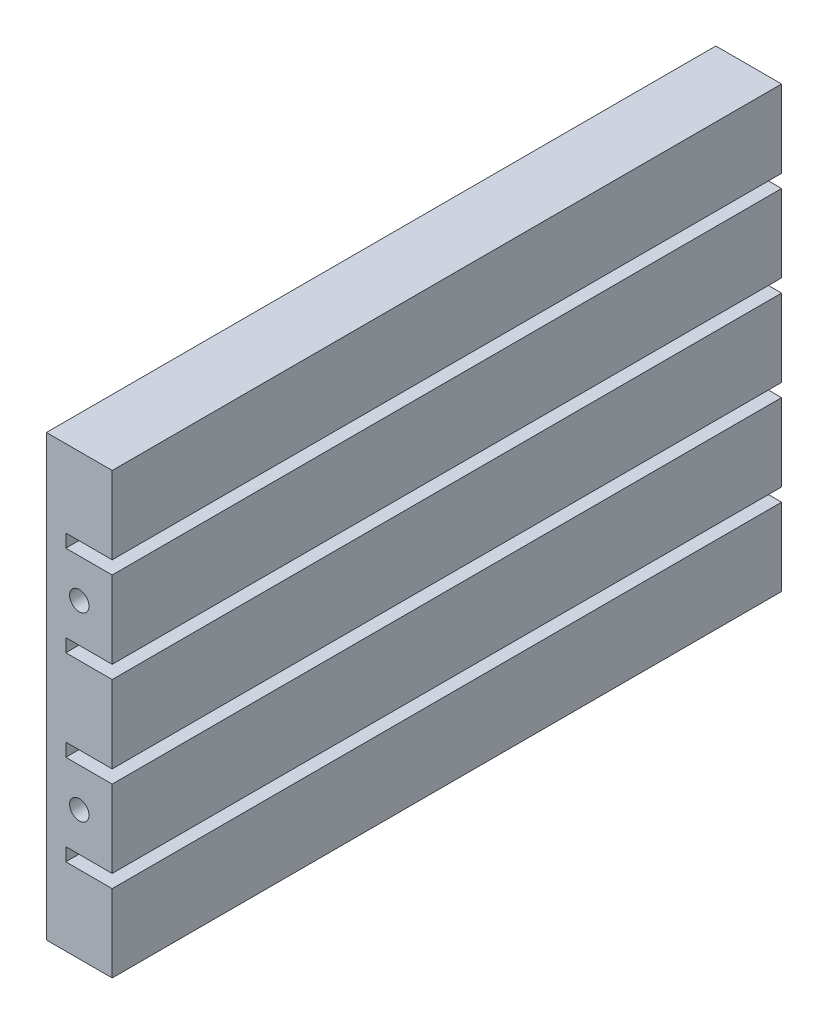
ISO-10303-21;
HEADER;
FILE_DESCRIPTION(('STEP AP214'),'2;1');
FILE_NAME('part.step','',(''),(''),'','','');
FILE_SCHEMA(('AUTOMOTIVE_DESIGN { 1 0 10303 214 1 1 1 1 }'));
ENDSEC;
DATA;
#1=APPLICATION_CONTEXT('core data for automotive mechanical design processes');
#2=APPLICATION_PROTOCOL_DEFINITION('international standard','automotive_design',2000,#1);
#3=PRODUCT_CONTEXT('',#1,'mechanical');
#4=PRODUCT('Part','Part','',(#3));
#5=PRODUCT_RELATED_PRODUCT_CATEGORY('part','',(#4));
#6=PRODUCT_DEFINITION_FORMATION('','',#4);
#7=PRODUCT_DEFINITION_CONTEXT('part definition',#1,'design');
#8=PRODUCT_DEFINITION('design','',#6,#7);
#9=PRODUCT_DEFINITION_SHAPE('','',#8);
#10=(LENGTH_UNIT() NAMED_UNIT(*) SI_UNIT(.MILLI.,.METRE.));
#11=(NAMED_UNIT(*) PLANE_ANGLE_UNIT() SI_UNIT($,.RADIAN.));
#12=(NAMED_UNIT(*) SI_UNIT($,.STERADIAN.) SOLID_ANGLE_UNIT());
#13=UNCERTAINTY_MEASURE_WITH_UNIT(LENGTH_MEASURE(1.E-05),#10,'distance_accuracy_value','');
#14=(GEOMETRIC_REPRESENTATION_CONTEXT(3) GLOBAL_UNCERTAINTY_ASSIGNED_CONTEXT((#13)) GLOBAL_UNIT_ASSIGNED_CONTEXT((#10,
#11,#12)) REPRESENTATION_CONTEXT('',''));
#15=CARTESIAN_POINT('',(0.,0.,0.));
#16=DIRECTION('',(0.,0.,1.));
#17=DIRECTION('',(1.,0.,0.));
#18=AXIS2_PLACEMENT_3D('',#15,#16,#17);
#19=CARTESIAN_POINT('',(8.50000000000001,0.,86.5));
#20=DIRECTION('',(0.,1.,0.));
#21=DIRECTION('',(0.,0.,1.));
#22=AXIS2_PLACEMENT_3D('',#19,#20,#21);
#23=PLANE('',#22);
#24=DIRECTION('',(1.,0.,0.));
#25=VECTOR('',#24,1.);
#26=CARTESIAN_POINT('',(8.50000000000001,0.,0.));
#27=LINE('',#26,#25);
#28=CARTESIAN_POINT('',(0.,0.,0.));
#29=VERTEX_POINT('',#28);
#30=CARTESIAN_POINT('',(8.50000000000001,0.,0.));
#31=VERTEX_POINT('',#30);
#32=EDGE_CURVE('E210',#29,#31,#27,.T.);
#33=ORIENTED_EDGE('',*,*,#32,.T.);
#34=DIRECTION('',(0.,0.,-1.));
#35=VECTOR('',#34,1.);
#36=CARTESIAN_POINT('',(8.50000000000001,0.,86.5));
#37=LINE('',#36,#35);
#38=CARTESIAN_POINT('',(8.50000000000001,0.,86.5));
#39=VERTEX_POINT('',#38);
#40=EDGE_CURVE('E11',#39,#31,#37,.T.);
#41=ORIENTED_EDGE('',*,*,#40,.F.);
#42=DIRECTION('',(1.,0.,0.));
#43=VECTOR('',#42,1.);
#44=CARTESIAN_POINT('',(8.50000000000001,0.,86.5));
#45=LINE('',#44,#43);
#46=CARTESIAN_POINT('',(0.,0.,86.5));
#47=VERTEX_POINT('',#46);
#48=EDGE_CURVE('E249',#47,#39,#45,.T.);
#49=ORIENTED_EDGE('',*,*,#48,.F.);
#50=DIRECTION('',(0.,0.,-1.));
#51=VECTOR('',#50,1.);
#52=CARTESIAN_POINT('',(0.,0.,86.5));
#53=LINE('',#52,#51);
#54=EDGE_CURVE('E206',#47,#29,#53,.T.);
#55=ORIENTED_EDGE('',*,*,#54,.T.);
#56=EDGE_LOOP('',(#33,#41,#49,#55));
#57=FACE_BOUND('',#56,.T.);
#58=ADVANCED_FACE('F39',(#57),#23,.F.);
#59=CARTESIAN_POINT('',(8.50000000000001,9.99999999999999,86.5));
#60=DIRECTION('',(-1.,0.,0.));
#61=DIRECTION('',(0.,0.,1.));
#62=AXIS2_PLACEMENT_3D('',#59,#60,#61);
#63=PLANE('',#62);
#64=DIRECTION('',(0.,1.,0.));
#65=VECTOR('',#64,1.);
#66=CARTESIAN_POINT('',(8.50000000000001,9.99999999999999,0.));
#67=LINE('',#66,#65);
#68=CARTESIAN_POINT('',(8.50000000000001,9.99999999999999,0.));
#69=VERTEX_POINT('',#68);
#70=EDGE_CURVE('E213',#31,#69,#67,.T.);
#71=ORIENTED_EDGE('',*,*,#70,.T.);
#72=DIRECTION('',(0.,0.,-1.));
#73=VECTOR('',#72,1.);
#74=CARTESIAN_POINT('',(8.50000000000001,9.99999999999999,86.5));
#75=LINE('',#74,#73);
#76=CARTESIAN_POINT('',(8.50000000000001,9.99999999999999,86.5));
#77=VERTEX_POINT('',#76);
#78=EDGE_CURVE('E47',#77,#69,#75,.T.);
#79=ORIENTED_EDGE('',*,*,#78,.F.);
#80=DIRECTION('',(0.,1.,0.));
#81=VECTOR('',#80,1.);
#82=CARTESIAN_POINT('',(8.50000000000001,9.99999999999999,86.5));
#83=LINE('',#82,#81);
#84=EDGE_CURVE('E135',#39,#77,#83,.T.);
#85=ORIENTED_EDGE('',*,*,#84,.F.);
#86=ORIENTED_EDGE('',*,*,#40,.T.);
#87=EDGE_LOOP('',(#71,#79,#85,#86));
#88=FACE_BOUND('',#87,.T.);
#89=ADVANCED_FACE('F373',(#88),#63,.F.);
#90=CARTESIAN_POINT('',(2.5,9.99999999999999,86.5));
#91=DIRECTION('',(0.,-1.,0.));
#92=DIRECTION('',(0.,0.,-1.));
#93=AXIS2_PLACEMENT_3D('',#90,#91,#92);
#94=PLANE('',#93);
#95=DIRECTION('',(-1.,0.,0.));
#96=VECTOR('',#95,1.);
#97=CARTESIAN_POINT('',(2.5,9.99999999999999,0.));
#98=LINE('',#97,#96);
#99=CARTESIAN_POINT('',(2.5,9.99999999999999,0.));
#100=VERTEX_POINT('',#99);
#101=EDGE_CURVE('E216',#69,#100,#98,.T.);
#102=ORIENTED_EDGE('',*,*,#101,.T.);
#103=DIRECTION('',(0.,0.,-1.));
#104=VECTOR('',#103,1.);
#105=CARTESIAN_POINT('',(2.5,9.99999999999999,86.5));
#106=LINE('',#105,#104);
#107=CARTESIAN_POINT('',(2.5,9.99999999999999,86.5));
#108=VERTEX_POINT('',#107);
#109=EDGE_CURVE('E292',#108,#100,#106,.T.);
#110=ORIENTED_EDGE('',*,*,#109,.F.);
#111=DIRECTION('',(-1.,0.,0.));
#112=VECTOR('',#111,1.);
#113=CARTESIAN_POINT('',(2.5,9.99999999999999,86.5));
#114=LINE('',#113,#112);
#115=EDGE_CURVE('E300',#77,#108,#114,.T.);
#116=ORIENTED_EDGE('',*,*,#115,.F.);
#117=ORIENTED_EDGE('',*,*,#78,.T.);
#118=EDGE_LOOP('',(#102,#110,#116,#117));
#119=FACE_BOUND('',#118,.T.);
#120=ADVANCED_FACE('F298',(#119),#94,.F.);
#121=CARTESIAN_POINT('',(2.5,11.7,86.5));
#122=DIRECTION('',(-1.,0.,0.));
#123=DIRECTION('',(0.,0.,1.));
#124=AXIS2_PLACEMENT_3D('',#121,#122,#123);
#125=PLANE('',#124);
#126=DIRECTION('',(0.,1.,0.));
#127=VECTOR('',#126,1.);
#128=CARTESIAN_POINT('',(2.5,11.7,0.));
#129=LINE('',#128,#127);
#130=CARTESIAN_POINT('',(2.5,11.7,0.));
#131=VERTEX_POINT('',#130);
#132=EDGE_CURVE('E218',#100,#131,#129,.T.);
#133=ORIENTED_EDGE('',*,*,#132,.T.);
#134=DIRECTION('',(0.,0.,-1.));
#135=VECTOR('',#134,1.);
#136=CARTESIAN_POINT('',(2.5,11.7,86.5));
#137=LINE('',#136,#135);
#138=CARTESIAN_POINT('',(2.5,11.7,86.5));
#139=VERTEX_POINT('',#138);
#140=EDGE_CURVE('E289',#139,#131,#137,.T.);
#141=ORIENTED_EDGE('',*,*,#140,.F.);
#142=DIRECTION('',(0.,1.,0.));
#143=VECTOR('',#142,1.);
#144=CARTESIAN_POINT('',(2.5,11.7,86.5));
#145=LINE('',#144,#143);
#146=EDGE_CURVE('E318',#108,#139,#145,.T.);
#147=ORIENTED_EDGE('',*,*,#146,.F.);
#148=ORIENTED_EDGE('',*,*,#109,.T.);
#149=EDGE_LOOP('',(#133,#141,#147,#148));
#150=FACE_BOUND('',#149,.T.);
#151=ADVANCED_FACE('F309',(#150),#125,.F.);
#152=CARTESIAN_POINT('',(8.50000000000001,11.7,86.5));
#153=DIRECTION('',(0.,1.,0.));
#154=DIRECTION('',(0.,0.,1.));
#155=AXIS2_PLACEMENT_3D('',#152,#153,#154);
#156=PLANE('',#155);
#157=DIRECTION('',(1.,0.,0.));
#158=VECTOR('',#157,1.);
#159=CARTESIAN_POINT('',(8.50000000000001,11.7,0.));
#160=LINE('',#159,#158);
#161=CARTESIAN_POINT('',(8.50000000000001,11.7,0.));
#162=VERTEX_POINT('',#161);
#163=EDGE_CURVE('E220',#131,#162,#160,.T.);
#164=ORIENTED_EDGE('',*,*,#163,.T.);
#165=DIRECTION('',(0.,0.,-1.));
#166=VECTOR('',#165,1.);
#167=CARTESIAN_POINT('',(8.50000000000001,11.7,86.5));
#168=LINE('',#167,#166);
#169=CARTESIAN_POINT('',(8.50000000000001,11.7,86.5));
#170=VERTEX_POINT('',#169);
#171=EDGE_CURVE('E286',#170,#162,#168,.T.);
#172=ORIENTED_EDGE('',*,*,#171,.F.);
#173=DIRECTION('',(1.,0.,0.));
#174=VECTOR('',#173,1.);
#175=CARTESIAN_POINT('',(8.50000000000001,11.7,86.5));
#176=LINE('',#175,#174);
#177=EDGE_CURVE('E315',#139,#170,#176,.T.);
#178=ORIENTED_EDGE('',*,*,#177,.F.);
#179=ORIENTED_EDGE('',*,*,#140,.T.);
#180=EDGE_LOOP('',(#164,#172,#178,#179));
#181=FACE_BOUND('',#180,.T.);
#182=ADVANCED_FACE('F313',(#181),#156,.F.);
#183=CARTESIAN_POINT('',(8.50000000000001,21.7,86.5));
#184=DIRECTION('',(-1.,0.,0.));
#185=DIRECTION('',(0.,-1.,0.));
#186=AXIS2_PLACEMENT_3D('',#183,#184,#185);
#187=PLANE('',#186);
#188=DIRECTION('',(0.,1.,0.));
#189=VECTOR('',#188,1.);
#190=CARTESIAN_POINT('',(8.50000000000001,21.7,0.));
#191=LINE('',#190,#189);
#192=CARTESIAN_POINT('',(8.50000000000001,21.7,0.));
#193=VERTEX_POINT('',#192);
#194=EDGE_CURVE('E222',#162,#193,#191,.T.);
#195=ORIENTED_EDGE('',*,*,#194,.T.);
#196=DIRECTION('',(0.,0.,-1.));
#197=VECTOR('',#196,1.);
#198=CARTESIAN_POINT('',(8.50000000000001,21.7,86.5));
#199=LINE('',#198,#197);
#200=CARTESIAN_POINT('',(8.50000000000001,21.7,86.5));
#201=VERTEX_POINT('',#200);
#202=EDGE_CURVE('E283',#201,#193,#199,.T.);
#203=ORIENTED_EDGE('',*,*,#202,.F.);
#204=DIRECTION('',(0.,1.,0.));
#205=VECTOR('',#204,1.);
#206=CARTESIAN_POINT('',(8.50000000000001,21.7,86.5));
#207=LINE('',#206,#205);
#208=EDGE_CURVE('E317',#170,#201,#207,.T.);
#209=ORIENTED_EDGE('',*,*,#208,.F.);
#210=ORIENTED_EDGE('',*,*,#171,.T.);
#211=EDGE_LOOP('',(#195,#203,#209,#210));
#212=FACE_BOUND('',#211,.T.);
#213=ADVANCED_FACE('F386',(#212),#187,.F.);
#214=CARTESIAN_POINT('',(2.5,21.7,86.5));
#215=DIRECTION('',(0.,-1.,0.));
#216=DIRECTION('',(0.,0.,-1.));
#217=AXIS2_PLACEMENT_3D('',#214,#215,#216);
#218=PLANE('',#217);
#219=DIRECTION('',(-1.,0.,0.));
#220=VECTOR('',#219,1.);
#221=CARTESIAN_POINT('',(2.5,21.7,0.));
#222=LINE('',#221,#220);
#223=CARTESIAN_POINT('',(2.5,21.7,0.));
#224=VERTEX_POINT('',#223);
#225=EDGE_CURVE('E224',#193,#224,#222,.T.);
#226=ORIENTED_EDGE('',*,*,#225,.T.);
#227=DIRECTION('',(0.,0.,-1.));
#228=VECTOR('',#227,1.);
#229=CARTESIAN_POINT('',(2.5,21.7,86.5));
#230=LINE('',#229,#228);
#231=CARTESIAN_POINT('',(2.5,21.7,86.5));
#232=VERTEX_POINT('',#231);
#233=EDGE_CURVE('E280',#232,#224,#230,.T.);
#234=ORIENTED_EDGE('',*,*,#233,.F.);
#235=DIRECTION('',(-1.,0.,0.));
#236=VECTOR('',#235,1.);
#237=CARTESIAN_POINT('',(2.5,21.7,86.5));
#238=LINE('',#237,#236);
#239=EDGE_CURVE('E320',#201,#232,#238,.T.);
#240=ORIENTED_EDGE('',*,*,#239,.F.);
#241=ORIENTED_EDGE('',*,*,#202,.T.);
#242=EDGE_LOOP('',(#226,#234,#240,#241));
#243=FACE_BOUND('',#242,.T.);
#244=ADVANCED_FACE('F389',(#243),#218,.F.);
#245=CARTESIAN_POINT('',(2.5,23.4,86.5));
#246=DIRECTION('',(-1.,0.,0.));
#247=DIRECTION('',(0.,0.,1.));
#248=AXIS2_PLACEMENT_3D('',#245,#246,#247);
#249=PLANE('',#248);
#250=DIRECTION('',(0.,1.,0.));
#251=VECTOR('',#250,1.);
#252=CARTESIAN_POINT('',(2.5,23.4,0.));
#253=LINE('',#252,#251);
#254=CARTESIAN_POINT('',(2.5,23.4,0.));
#255=VERTEX_POINT('',#254);
#256=EDGE_CURVE('E226',#224,#255,#253,.T.);
#257=ORIENTED_EDGE('',*,*,#256,.T.);
#258=DIRECTION('',(0.,0.,-1.));
#259=VECTOR('',#258,1.);
#260=CARTESIAN_POINT('',(2.5,23.4,86.5));
#261=LINE('',#260,#259);
#262=CARTESIAN_POINT('',(2.5,23.4,86.5));
#263=VERTEX_POINT('',#262);
#264=EDGE_CURVE('E277',#263,#255,#261,.T.);
#265=ORIENTED_EDGE('',*,*,#264,.F.);
#266=DIRECTION('',(0.,1.,0.));
#267=VECTOR('',#266,1.);
#268=CARTESIAN_POINT('',(2.5,23.4,86.5));
#269=LINE('',#268,#267);
#270=EDGE_CURVE('E326',#232,#263,#269,.T.);
#271=ORIENTED_EDGE('',*,*,#270,.F.);
#272=ORIENTED_EDGE('',*,*,#233,.T.);
#273=EDGE_LOOP('',(#257,#265,#271,#272));
#274=FACE_BOUND('',#273,.T.);
#275=ADVANCED_FACE('F393',(#274),#249,.F.);
#276=CARTESIAN_POINT('',(8.50000000000001,23.4,86.5));
#277=DIRECTION('',(0.,1.,0.));
#278=DIRECTION('',(0.,0.,1.));
#279=AXIS2_PLACEMENT_3D('',#276,#277,#278);
#280=PLANE('',#279);
#281=DIRECTION('',(1.,0.,0.));
#282=VECTOR('',#281,1.);
#283=CARTESIAN_POINT('',(8.50000000000001,23.4,0.));
#284=LINE('',#283,#282);
#285=CARTESIAN_POINT('',(8.50000000000001,23.4,0.));
#286=VERTEX_POINT('',#285);
#287=EDGE_CURVE('E228',#255,#286,#284,.T.);
#288=ORIENTED_EDGE('',*,*,#287,.T.);
#289=DIRECTION('',(0.,0.,-1.));
#290=VECTOR('',#289,1.);
#291=CARTESIAN_POINT('',(8.50000000000001,23.4,86.5));
#292=LINE('',#291,#290);
#293=CARTESIAN_POINT('',(8.50000000000001,23.4,86.5));
#294=VERTEX_POINT('',#293);
#295=EDGE_CURVE('E274',#294,#286,#292,.T.);
#296=ORIENTED_EDGE('',*,*,#295,.F.);
#297=DIRECTION('',(1.,0.,0.));
#298=VECTOR('',#297,1.);
#299=CARTESIAN_POINT('',(8.50000000000001,23.4,86.5));
#300=LINE('',#299,#298);
#301=EDGE_CURVE('E328',#263,#294,#300,.T.);
#302=ORIENTED_EDGE('',*,*,#301,.F.);
#303=ORIENTED_EDGE('',*,*,#264,.T.);
#304=EDGE_LOOP('',(#288,#296,#302,#303));
#305=FACE_BOUND('',#304,.T.);
#306=ADVANCED_FACE('F397',(#305),#280,.F.);
#307=CARTESIAN_POINT('',(8.5,33.4,86.5));
#308=DIRECTION('',(-1.,0.,0.));
#309=DIRECTION('',(0.,-1.,0.));
#310=AXIS2_PLACEMENT_3D('',#307,#308,#309);
#311=PLANE('',#310);
#312=DIRECTION('',(0.,1.,0.));
#313=VECTOR('',#312,1.);
#314=CARTESIAN_POINT('',(8.5,33.4,0.));
#315=LINE('',#314,#313);
#316=CARTESIAN_POINT('',(8.5,33.4,0.));
#317=VERTEX_POINT('',#316);
#318=EDGE_CURVE('E230',#286,#317,#315,.T.);
#319=ORIENTED_EDGE('',*,*,#318,.T.);
#320=DIRECTION('',(0.,0.,-1.));
#321=VECTOR('',#320,1.);
#322=CARTESIAN_POINT('',(8.5,33.4,86.5));
#323=LINE('',#322,#321);
#324=CARTESIAN_POINT('',(8.5,33.4,86.5));
#325=VERTEX_POINT('',#324);
#326=EDGE_CURVE('E271',#325,#317,#323,.T.);
#327=ORIENTED_EDGE('',*,*,#326,.F.);
#328=DIRECTION('',(0.,1.,0.));
#329=VECTOR('',#328,1.);
#330=CARTESIAN_POINT('',(8.5,33.4,86.5));
#331=LINE('',#330,#329);
#332=EDGE_CURVE('E330',#294,#325,#331,.T.);
#333=ORIENTED_EDGE('',*,*,#332,.F.);
#334=ORIENTED_EDGE('',*,*,#295,.T.);
#335=EDGE_LOOP('',(#319,#327,#333,#334));
#336=FACE_BOUND('',#335,.T.);
#337=ADVANCED_FACE('F401',(#336),#311,.F.);
#338=CARTESIAN_POINT('',(2.5,33.4,86.5));
#339=DIRECTION('',(0.,-1.,0.));
#340=DIRECTION('',(0.,0.,-1.));
#341=AXIS2_PLACEMENT_3D('',#338,#339,#340);
#342=PLANE('',#341);
#343=DIRECTION('',(-1.,0.,0.));
#344=VECTOR('',#343,1.);
#345=CARTESIAN_POINT('',(2.5,33.4,0.));
#346=LINE('',#345,#344);
#347=CARTESIAN_POINT('',(2.5,33.4,0.));
#348=VERTEX_POINT('',#347);
#349=EDGE_CURVE('E232',#317,#348,#346,.T.);
#350=ORIENTED_EDGE('',*,*,#349,.T.);
#351=DIRECTION('',(0.,0.,-1.));
#352=VECTOR('',#351,1.);
#353=CARTESIAN_POINT('',(2.5,33.4,86.5));
#354=LINE('',#353,#352);
#355=CARTESIAN_POINT('',(2.5,33.4,86.5));
#356=VERTEX_POINT('',#355);
#357=EDGE_CURVE('E268',#356,#348,#354,.T.);
#358=ORIENTED_EDGE('',*,*,#357,.F.);
#359=DIRECTION('',(-1.,0.,0.));
#360=VECTOR('',#359,1.);
#361=CARTESIAN_POINT('',(2.5,33.4,86.5));
#362=LINE('',#361,#360);
#363=EDGE_CURVE('E332',#325,#356,#362,.T.);
#364=ORIENTED_EDGE('',*,*,#363,.F.);
#365=ORIENTED_EDGE('',*,*,#326,.T.);
#366=EDGE_LOOP('',(#350,#358,#364,#365));
#367=FACE_BOUND('',#366,.T.);
#368=ADVANCED_FACE('F405',(#367),#342,.F.);
#369=CARTESIAN_POINT('',(2.5,35.1,86.5));
#370=DIRECTION('',(-1.,0.,0.));
#371=DIRECTION('',(0.,0.,1.));
#372=AXIS2_PLACEMENT_3D('',#369,#370,#371);
#373=PLANE('',#372);
#374=DIRECTION('',(0.,1.,0.));
#375=VECTOR('',#374,1.);
#376=CARTESIAN_POINT('',(2.5,35.1,0.));
#377=LINE('',#376,#375);
#378=CARTESIAN_POINT('',(2.5,35.1,0.));
#379=VERTEX_POINT('',#378);
#380=EDGE_CURVE('E234',#348,#379,#377,.T.);
#381=ORIENTED_EDGE('',*,*,#380,.T.);
#382=DIRECTION('',(0.,0.,-1.));
#383=VECTOR('',#382,1.);
#384=CARTESIAN_POINT('',(2.5,35.1,86.5));
#385=LINE('',#384,#383);
#386=CARTESIAN_POINT('',(2.5,35.1,86.5));
#387=VERTEX_POINT('',#386);
#388=EDGE_CURVE('E265',#387,#379,#385,.T.);
#389=ORIENTED_EDGE('',*,*,#388,.F.);
#390=DIRECTION('',(0.,1.,0.));
#391=VECTOR('',#390,1.);
#392=CARTESIAN_POINT('',(2.5,35.1,86.5));
#393=LINE('',#392,#391);
#394=EDGE_CURVE('E334',#356,#387,#393,.T.);
#395=ORIENTED_EDGE('',*,*,#394,.F.);
#396=ORIENTED_EDGE('',*,*,#357,.T.);
#397=EDGE_LOOP('',(#381,#389,#395,#396));
#398=FACE_BOUND('',#397,.T.);
#399=ADVANCED_FACE('F409',(#398),#373,.F.);
#400=CARTESIAN_POINT('',(8.5,35.1,86.5));
#401=DIRECTION('',(0.,1.,0.));
#402=DIRECTION('',(0.,0.,1.));
#403=AXIS2_PLACEMENT_3D('',#400,#401,#402);
#404=PLANE('',#403);
#405=DIRECTION('',(1.,0.,0.));
#406=VECTOR('',#405,1.);
#407=CARTESIAN_POINT('',(8.5,35.1,0.));
#408=LINE('',#407,#406);
#409=CARTESIAN_POINT('',(8.5,35.1,0.));
#410=VERTEX_POINT('',#409);
#411=EDGE_CURVE('E236',#379,#410,#408,.T.);
#412=ORIENTED_EDGE('',*,*,#411,.T.);
#413=DIRECTION('',(0.,0.,-1.));
#414=VECTOR('',#413,1.);
#415=CARTESIAN_POINT('',(8.5,35.1,86.5));
#416=LINE('',#415,#414);
#417=CARTESIAN_POINT('',(8.5,35.1,86.5));
#418=VERTEX_POINT('',#417);
#419=EDGE_CURVE('E262',#418,#410,#416,.T.);
#420=ORIENTED_EDGE('',*,*,#419,.F.);
#421=DIRECTION('',(1.,0.,0.));
#422=VECTOR('',#421,1.);
#423=CARTESIAN_POINT('',(8.5,35.1,86.5));
#424=LINE('',#423,#422);
#425=EDGE_CURVE('E336',#387,#418,#424,.T.);
#426=ORIENTED_EDGE('',*,*,#425,.F.);
#427=ORIENTED_EDGE('',*,*,#388,.T.);
#428=EDGE_LOOP('',(#412,#420,#426,#427));
#429=FACE_BOUND('',#428,.T.);
#430=ADVANCED_FACE('F413',(#429),#404,.F.);
#431=CARTESIAN_POINT('',(8.5,45.1,86.5));
#432=DIRECTION('',(-1.,0.,0.));
#433=DIRECTION('',(0.,-1.,0.));
#434=AXIS2_PLACEMENT_3D('',#431,#432,#433);
#435=PLANE('',#434);
#436=DIRECTION('',(0.,1.,0.));
#437=VECTOR('',#436,1.);
#438=CARTESIAN_POINT('',(8.5,45.1,0.));
#439=LINE('',#438,#437);
#440=CARTESIAN_POINT('',(8.5,45.1,0.));
#441=VERTEX_POINT('',#440);
#442=EDGE_CURVE('E238',#410,#441,#439,.T.);
#443=ORIENTED_EDGE('',*,*,#442,.T.);
#444=DIRECTION('',(0.,0.,-1.));
#445=VECTOR('',#444,1.);
#446=CARTESIAN_POINT('',(8.5,45.1,86.5));
#447=LINE('',#446,#445);
#448=CARTESIAN_POINT('',(8.5,45.1,86.5));
#449=VERTEX_POINT('',#448);
#450=EDGE_CURVE('E259',#449,#441,#447,.T.);
#451=ORIENTED_EDGE('',*,*,#450,.F.);
#452=DIRECTION('',(0.,1.,0.));
#453=VECTOR('',#452,1.);
#454=CARTESIAN_POINT('',(8.5,45.1,86.5));
#455=LINE('',#454,#453);
#456=EDGE_CURVE('E338',#418,#449,#455,.T.);
#457=ORIENTED_EDGE('',*,*,#456,.F.);
#458=ORIENTED_EDGE('',*,*,#419,.T.);
#459=EDGE_LOOP('',(#443,#451,#457,#458));
#460=FACE_BOUND('',#459,.T.);
#461=ADVANCED_FACE('F417',(#460),#435,.F.);
#462=CARTESIAN_POINT('',(2.5,45.1,86.5));
#463=DIRECTION('',(0.,-1.,0.));
#464=DIRECTION('',(0.,0.,-1.));
#465=AXIS2_PLACEMENT_3D('',#462,#463,#464);
#466=PLANE('',#465);
#467=DIRECTION('',(-1.,0.,0.));
#468=VECTOR('',#467,1.);
#469=CARTESIAN_POINT('',(2.5,45.1,0.));
#470=LINE('',#469,#468);
#471=CARTESIAN_POINT('',(2.5,45.1,0.));
#472=VERTEX_POINT('',#471);
#473=EDGE_CURVE('E240',#441,#472,#470,.T.);
#474=ORIENTED_EDGE('',*,*,#473,.T.);
#475=DIRECTION('',(0.,0.,-1.));
#476=VECTOR('',#475,1.);
#477=CARTESIAN_POINT('',(2.5,45.1,86.5));
#478=LINE('',#477,#476);
#479=CARTESIAN_POINT('',(2.5,45.1,86.5));
#480=VERTEX_POINT('',#479);
#481=EDGE_CURVE('E256',#480,#472,#478,.T.);
#482=ORIENTED_EDGE('',*,*,#481,.F.);
#483=DIRECTION('',(-1.,0.,0.));
#484=VECTOR('',#483,1.);
#485=CARTESIAN_POINT('',(2.5,45.1,86.5));
#486=LINE('',#485,#484);
#487=EDGE_CURVE('E340',#449,#480,#486,.T.);
#488=ORIENTED_EDGE('',*,*,#487,.F.);
#489=ORIENTED_EDGE('',*,*,#450,.T.);
#490=EDGE_LOOP('',(#474,#482,#488,#489));
#491=FACE_BOUND('',#490,.T.);
#492=ADVANCED_FACE('F421',(#491),#466,.F.);
#493=CARTESIAN_POINT('',(2.5,46.8,86.5));
#494=DIRECTION('',(-1.,0.,0.));
#495=DIRECTION('',(0.,0.,1.));
#496=AXIS2_PLACEMENT_3D('',#493,#494,#495);
#497=PLANE('',#496);
#498=DIRECTION('',(0.,1.,0.));
#499=VECTOR('',#498,1.);
#500=CARTESIAN_POINT('',(2.5,46.8,0.));
#501=LINE('',#500,#499);
#502=CARTESIAN_POINT('',(2.5,46.8,0.));
#503=VERTEX_POINT('',#502);
#504=EDGE_CURVE('E242',#472,#503,#501,.T.);
#505=ORIENTED_EDGE('',*,*,#504,.T.);
#506=DIRECTION('',(0.,0.,-1.));
#507=VECTOR('',#506,1.);
#508=CARTESIAN_POINT('',(2.5,46.8,86.5));
#509=LINE('',#508,#507);
#510=CARTESIAN_POINT('',(2.5,46.8,86.5));
#511=VERTEX_POINT('',#510);
#512=EDGE_CURVE('E253',#511,#503,#509,.T.);
#513=ORIENTED_EDGE('',*,*,#512,.F.);
#514=DIRECTION('',(0.,1.,0.));
#515=VECTOR('',#514,1.);
#516=CARTESIAN_POINT('',(2.5,46.8,86.5));
#517=LINE('',#516,#515);
#518=EDGE_CURVE('E342',#480,#511,#517,.T.);
#519=ORIENTED_EDGE('',*,*,#518,.F.);
#520=ORIENTED_EDGE('',*,*,#481,.T.);
#521=EDGE_LOOP('',(#505,#513,#519,#520));
#522=FACE_BOUND('',#521,.T.);
#523=ADVANCED_FACE('F348',(#522),#497,.F.);
#524=CARTESIAN_POINT('',(8.5,46.8,86.5));
#525=DIRECTION('',(0.,1.,0.));
#526=DIRECTION('',(0.,0.,1.));
#527=AXIS2_PLACEMENT_3D('',#524,#525,#526);
#528=PLANE('',#527);
#529=DIRECTION('',(1.,0.,0.));
#530=VECTOR('',#529,1.);
#531=CARTESIAN_POINT('',(8.5,46.8,0.));
#532=LINE('',#531,#530);
#533=CARTESIAN_POINT('',(8.5,46.8,0.));
#534=VERTEX_POINT('',#533);
#535=EDGE_CURVE('E244',#503,#534,#532,.T.);
#536=ORIENTED_EDGE('',*,*,#535,.T.);
#537=DIRECTION('',(0.,0.,-1.));
#538=VECTOR('',#537,1.);
#539=CARTESIAN_POINT('',(8.5,46.8,86.5));
#540=LINE('',#539,#538);
#541=CARTESIAN_POINT('',(8.5,46.8,86.5));
#542=VERTEX_POINT('',#541);
#543=EDGE_CURVE('E201',#542,#534,#540,.T.);
#544=ORIENTED_EDGE('',*,*,#543,.F.);
#545=DIRECTION('',(1.,0.,0.));
#546=VECTOR('',#545,1.);
#547=CARTESIAN_POINT('',(8.5,46.8,86.5));
#548=LINE('',#547,#546);
#549=EDGE_CURVE('E192',#511,#542,#548,.T.);
#550=ORIENTED_EDGE('',*,*,#549,.F.);
#551=ORIENTED_EDGE('',*,*,#512,.T.);
#552=EDGE_LOOP('',(#536,#544,#550,#551));
#553=FACE_BOUND('',#552,.T.);
#554=ADVANCED_FACE('F352',(#553),#528,.F.);
#555=CARTESIAN_POINT('',(8.5,56.8,86.5));
#556=DIRECTION('',(-1.,0.,0.));
#557=DIRECTION('',(0.,-1.,0.));
#558=AXIS2_PLACEMENT_3D('',#555,#556,#557);
#559=PLANE('',#558);
#560=DIRECTION('',(0.,1.,0.));
#561=VECTOR('',#560,1.);
#562=CARTESIAN_POINT('',(8.5,56.8,0.));
#563=LINE('',#562,#561);
#564=CARTESIAN_POINT('',(8.5,56.8,0.));
#565=VERTEX_POINT('',#564);
#566=EDGE_CURVE('E200',#534,#565,#563,.T.);
#567=ORIENTED_EDGE('',*,*,#566,.T.);
#568=DIRECTION('',(0.,0.,-1.));
#569=VECTOR('',#568,1.);
#570=CARTESIAN_POINT('',(8.5,56.8,86.5));
#571=LINE('',#570,#569);
#572=CARTESIAN_POINT('',(8.5,56.8,86.5));
#573=VERTEX_POINT('',#572);
#574=EDGE_CURVE('E197',#573,#565,#571,.T.);
#575=ORIENTED_EDGE('',*,*,#574,.F.);
#576=DIRECTION('',(0.,1.,0.));
#577=VECTOR('',#576,1.);
#578=CARTESIAN_POINT('',(8.5,56.8,86.5));
#579=LINE('',#578,#577);
#580=EDGE_CURVE('E186',#542,#573,#579,.T.);
#581=ORIENTED_EDGE('',*,*,#580,.F.);
#582=ORIENTED_EDGE('',*,*,#543,.T.);
#583=EDGE_LOOP('',(#567,#575,#581,#582));
#584=FACE_BOUND('',#583,.T.);
#585=ADVANCED_FACE('F198',(#584),#559,.F.);
#586=CARTESIAN_POINT('',(0.,56.8,86.5));
#587=DIRECTION('',(0.,-1.,0.));
#588=DIRECTION('',(0.,0.,-1.));
#589=AXIS2_PLACEMENT_3D('',#586,#587,#588);
#590=PLANE('',#589);
#591=DIRECTION('',(-1.,0.,0.));
#592=VECTOR('',#591,1.);
#593=CARTESIAN_POINT('',(0.,56.8,0.));
#594=LINE('',#593,#592);
#595=CARTESIAN_POINT('',(0.,56.8,0.));
#596=VERTEX_POINT('',#595);
#597=EDGE_CURVE('E121',#565,#596,#594,.T.);
#598=ORIENTED_EDGE('',*,*,#597,.T.);
#599=DIRECTION('',(0.,0.,-1.));
#600=VECTOR('',#599,1.);
#601=CARTESIAN_POINT('',(0.,56.8,86.5));
#602=LINE('',#601,#600);
#603=CARTESIAN_POINT('',(0.,56.8,86.5));
#604=VERTEX_POINT('',#603);
#605=EDGE_CURVE('E202',#604,#596,#602,.T.);
#606=ORIENTED_EDGE('',*,*,#605,.F.);
#607=DIRECTION('',(-1.,0.,0.));
#608=VECTOR('',#607,1.);
#609=CARTESIAN_POINT('',(0.,56.8,86.5));
#610=LINE('',#609,#608);
#611=EDGE_CURVE('E190',#573,#604,#610,.T.);
#612=ORIENTED_EDGE('',*,*,#611,.F.);
#613=ORIENTED_EDGE('',*,*,#574,.T.);
#614=EDGE_LOOP('',(#598,#606,#612,#613));
#615=FACE_BOUND('',#614,.T.);
#616=ADVANCED_FACE('F204',(#615),#590,.F.);
#617=CARTESIAN_POINT('',(0.,0.,86.5));
#618=DIRECTION('',(1.,0.,0.));
#619=DIRECTION('',(0.,0.,-1.));
#620=AXIS2_PLACEMENT_3D('',#617,#618,#619);
#621=PLANE('',#620);
#622=CARTESIAN_POINT('',(0.,51.8,78.25));
#623=DIRECTION('',(-1.,0.,0.));
#624=DIRECTION('',(0.,0.,1.));
#625=AXIS2_PLACEMENT_3D('',#622,#623,#624);
#626=CIRCLE('',#625,1.25);
#627=CARTESIAN_POINT('',(0.,51.8,79.5));
#628=VERTEX_POINT('',#627);
#629=EDGE_CURVE('E622',#628,#628,#626,.T.);
#630=ORIENTED_EDGE('',*,*,#629,.F.);
#631=EDGE_LOOP('',(#630));
#632=FACE_BOUND('',#631,.T.);
#633=CARTESIAN_POINT('',(0.,5.,78.25));
#634=DIRECTION('',(-1.,0.,0.));
#635=DIRECTION('',(0.,0.,1.));
#636=AXIS2_PLACEMENT_3D('',#633,#634,#635);
#637=CIRCLE('',#636,1.25);
#638=CARTESIAN_POINT('',(0.,5.,79.5));
#639=VERTEX_POINT('',#638);
#640=EDGE_CURVE('E624',#639,#639,#637,.T.);
#641=ORIENTED_EDGE('',*,*,#640,.F.);
#642=EDGE_LOOP('',(#641));
#643=FACE_BOUND('',#642,.T.);
#644=CARTESIAN_POINT('',(0.,51.8,8.24999999999999));
#645=DIRECTION('',(-1.,0.,0.));
#646=DIRECTION('',(0.,0.,1.));
#647=AXIS2_PLACEMENT_3D('',#644,#645,#646);
#648=CIRCLE('',#647,1.25);
#649=CARTESIAN_POINT('',(0.,51.8,9.49999999999999));
#650=VERTEX_POINT('',#649);
#651=EDGE_CURVE('E632',#650,#650,#648,.T.);
#652=ORIENTED_EDGE('',*,*,#651,.F.);
#653=EDGE_LOOP('',(#652));
#654=FACE_BOUND('',#653,.T.);
#655=CARTESIAN_POINT('',(0.,5.,8.24999999999999));
#656=DIRECTION('',(-1.,0.,0.));
#657=DIRECTION('',(0.,0.,1.));
#658=AXIS2_PLACEMENT_3D('',#655,#656,#657);
#659=CIRCLE('',#658,1.25);
#660=CARTESIAN_POINT('',(0.,5.,9.49999999999999));
#661=VERTEX_POINT('',#660);
#662=EDGE_CURVE('E638',#661,#661,#659,.T.);
#663=ORIENTED_EDGE('',*,*,#662,.F.);
#664=EDGE_LOOP('',(#663));
#665=FACE_BOUND('',#664,.T.);
#666=DIRECTION('',(0.,-1.,0.));
#667=VECTOR('',#666,1.);
#668=CARTESIAN_POINT('',(0.,0.,0.));
#669=LINE('',#668,#667);
#670=EDGE_CURVE('E127',#596,#29,#669,.T.);
#671=ORIENTED_EDGE('',*,*,#670,.T.);
#672=ORIENTED_EDGE('',*,*,#54,.F.);
#673=DIRECTION('',(0.,-1.,0.));
#674=VECTOR('',#673,1.);
#675=CARTESIAN_POINT('',(0.,0.,86.5));
#676=LINE('',#675,#674);
#677=EDGE_CURVE('E55',#604,#47,#676,.T.);
#678=ORIENTED_EDGE('',*,*,#677,.F.);
#679=ORIENTED_EDGE('',*,*,#605,.T.);
#680=EDGE_LOOP('',(#671,#672,#678,#679));
#681=FACE_BOUND('',#680,.T.);
#682=ADVANCED_FACE('F356',(#632,#643,#654,#665,#681),#621,.F.);
#683=CARTESIAN_POINT('',(0.,0.,86.5));
#684=DIRECTION('',(0.,0.,-1.));
#685=DIRECTION('',(-1.,0.,0.));
#686=AXIS2_PLACEMENT_3D('',#683,#684,#685);
#687=PLANE('',#686);
#688=CARTESIAN_POINT('',(4.25,40.1,86.5));
#689=DIRECTION('',(0.,0.,1.));
#690=DIRECTION('',(1.,0.,0.));
#691=AXIS2_PLACEMENT_3D('',#688,#689,#690);
#692=CIRCLE('',#691,1.25);
#693=CARTESIAN_POINT('',(5.5,40.1,86.5));
#694=VERTEX_POINT('',#693);
#695=EDGE_CURVE('E656',#694,#694,#692,.T.);
#696=ORIENTED_EDGE('',*,*,#695,.F.);
#697=EDGE_LOOP('',(#696));
#698=FACE_BOUND('',#697,.T.);
#699=CARTESIAN_POINT('',(4.25,16.7,86.5));
#700=DIRECTION('',(0.,0.,1.));
#701=DIRECTION('',(1.,0.,0.));
#702=AXIS2_PLACEMENT_3D('',#699,#700,#701);
#703=CIRCLE('',#702,1.25);
#704=CARTESIAN_POINT('',(5.5,16.7,86.5));
#705=VERTEX_POINT('',#704);
#706=EDGE_CURVE('E662',#705,#705,#703,.T.);
#707=ORIENTED_EDGE('',*,*,#706,.F.);
#708=EDGE_LOOP('',(#707));
#709=FACE_BOUND('',#708,.T.);
#710=ORIENTED_EDGE('',*,*,#48,.T.);
#711=ORIENTED_EDGE('',*,*,#84,.T.);
#712=ORIENTED_EDGE('',*,*,#115,.T.);
#713=ORIENTED_EDGE('',*,*,#146,.T.);
#714=ORIENTED_EDGE('',*,*,#177,.T.);
#715=ORIENTED_EDGE('',*,*,#208,.T.);
#716=ORIENTED_EDGE('',*,*,#239,.T.);
#717=ORIENTED_EDGE('',*,*,#270,.T.);
#718=ORIENTED_EDGE('',*,*,#301,.T.);
#719=ORIENTED_EDGE('',*,*,#332,.T.);
#720=ORIENTED_EDGE('',*,*,#363,.T.);
#721=ORIENTED_EDGE('',*,*,#394,.T.);
#722=ORIENTED_EDGE('',*,*,#425,.T.);
#723=ORIENTED_EDGE('',*,*,#456,.T.);
#724=ORIENTED_EDGE('',*,*,#487,.T.);
#725=ORIENTED_EDGE('',*,*,#518,.T.);
#726=ORIENTED_EDGE('',*,*,#549,.T.);
#727=ORIENTED_EDGE('',*,*,#580,.T.);
#728=ORIENTED_EDGE('',*,*,#611,.T.);
#729=ORIENTED_EDGE('',*,*,#677,.T.);
#730=EDGE_LOOP('',(#710,#711,#712,#713,#714,#715,#716,#717,#718,#719,#720,#721,#722,#723,#724,
#725,#726,#727,#728,#729));
#731=FACE_BOUND('',#730,.T.);
#732=ADVANCED_FACE('F188',(#698,#709,#731),#687,.F.);
#733=CARTESIAN_POINT('',(0.,0.,0.));
#734=DIRECTION('',(0.,0.,-1.));
#735=DIRECTION('',(-1.,0.,0.));
#736=AXIS2_PLACEMENT_3D('',#733,#734,#735);
#737=PLANE('',#736);
#738=CARTESIAN_POINT('',(4.25,40.1,0.));
#739=DIRECTION('',(0.,0.,-1.));
#740=DIRECTION('',(-1.,0.,0.));
#741=AXIS2_PLACEMENT_3D('',#738,#739,#740);
#742=CIRCLE('',#741,1.25);
#743=CARTESIAN_POINT('',(3.,40.1,0.));
#744=VERTEX_POINT('',#743);
#745=EDGE_CURVE('E644',#744,#744,#742,.T.);
#746=ORIENTED_EDGE('',*,*,#745,.F.);
#747=EDGE_LOOP('',(#746));
#748=FACE_BOUND('',#747,.T.);
#749=CARTESIAN_POINT('',(4.25,16.7,0.));
#750=DIRECTION('',(0.,0.,-1.));
#751=DIRECTION('',(-1.,0.,0.));
#752=AXIS2_PLACEMENT_3D('',#749,#750,#751);
#753=CIRCLE('',#752,1.25);
#754=CARTESIAN_POINT('',(3.,16.7,0.));
#755=VERTEX_POINT('',#754);
#756=EDGE_CURVE('E650',#755,#755,#753,.T.);
#757=ORIENTED_EDGE('',*,*,#756,.F.);
#758=EDGE_LOOP('',(#757));
#759=FACE_BOUND('',#758,.T.);
#760=ORIENTED_EDGE('',*,*,#32,.F.);
#761=ORIENTED_EDGE('',*,*,#670,.F.);
#762=ORIENTED_EDGE('',*,*,#597,.F.);
#763=ORIENTED_EDGE('',*,*,#566,.F.);
#764=ORIENTED_EDGE('',*,*,#535,.F.);
#765=ORIENTED_EDGE('',*,*,#504,.F.);
#766=ORIENTED_EDGE('',*,*,#473,.F.);
#767=ORIENTED_EDGE('',*,*,#442,.F.);
#768=ORIENTED_EDGE('',*,*,#411,.F.);
#769=ORIENTED_EDGE('',*,*,#380,.F.);
#770=ORIENTED_EDGE('',*,*,#349,.F.);
#771=ORIENTED_EDGE('',*,*,#318,.F.);
#772=ORIENTED_EDGE('',*,*,#287,.F.);
#773=ORIENTED_EDGE('',*,*,#256,.F.);
#774=ORIENTED_EDGE('',*,*,#225,.F.);
#775=ORIENTED_EDGE('',*,*,#194,.F.);
#776=ORIENTED_EDGE('',*,*,#163,.F.);
#777=ORIENTED_EDGE('',*,*,#132,.F.);
#778=ORIENTED_EDGE('',*,*,#101,.F.);
#779=ORIENTED_EDGE('',*,*,#70,.F.);
#780=EDGE_LOOP('',(#760,#761,#762,#763,#764,#765,#766,#767,#768,#769,#770,#771,#772,#773,#774,
#775,#776,#777,#778,#779));
#781=FACE_BOUND('',#780,.T.);
#782=ADVANCED_FACE('F304',(#748,#759,#781),#737,.T.);
#783=CARTESIAN_POINT('',(4.25,16.7,81.5));
#784=DIRECTION('',(0.,0.,1.));
#785=DIRECTION('',(1.,0.,0.));
#786=AXIS2_PLACEMENT_3D('',#783,#784,#785);
#787=CONICAL_SURFACE('',#786,1.25,1.02974425867666);
#788=CARTESIAN_POINT('',(4.25,16.7,80.7489242262155));
#789=VERTEX_POINT('',#788);
#790=VERTEX_LOOP('',#789);
#791=FACE_BOUND('',#790,.T.);
#792=CARTESIAN_POINT('',(4.25,16.7,81.5));
#793=DIRECTION('',(0.,0.,1.));
#794=DIRECTION('',(1.,0.,0.));
#795=AXIS2_PLACEMENT_3D('',#792,#793,#794);
#796=CIRCLE('',#795,1.25);
#797=CARTESIAN_POINT('',(5.5,16.7,81.5));
#798=VERTEX_POINT('',#797);
#799=EDGE_CURVE('E214',#798,#798,#796,.T.);
#800=ORIENTED_EDGE('',*,*,#799,.T.);
#801=EDGE_LOOP('',(#800));
#802=FACE_BOUND('',#801,.T.);
#803=ADVANCED_FACE('F457',(#791,#802),#787,.F.);
#804=CARTESIAN_POINT('',(4.25,16.7,86.5));
#805=DIRECTION('',(0.,0.,1.));
#806=DIRECTION('',(1.,0.,0.));
#807=AXIS2_PLACEMENT_3D('',#804,#805,#806);
#808=CYLINDRICAL_SURFACE('',#807,1.25);
#809=ORIENTED_EDGE('',*,*,#799,.F.);
#810=EDGE_LOOP('',(#809));
#811=FACE_BOUND('',#810,.T.);
#812=ORIENTED_EDGE('',*,*,#706,.T.);
#813=EDGE_LOOP('',(#812));
#814=FACE_BOUND('',#813,.T.);
#815=ADVANCED_FACE('F467',(#811,#814),#808,.F.);
#816=CARTESIAN_POINT('',(4.25,40.1,81.5));
#817=DIRECTION('',(0.,0.,1.));
#818=DIRECTION('',(1.,0.,0.));
#819=AXIS2_PLACEMENT_3D('',#816,#817,#818);
#820=CONICAL_SURFACE('',#819,1.25,1.02974425867666);
#821=CARTESIAN_POINT('',(4.25,40.1,80.7489242262155));
#822=VERTEX_POINT('',#821);
#823=VERTEX_LOOP('',#822);
#824=FACE_BOUND('',#823,.T.);
#825=CARTESIAN_POINT('',(4.25,40.1,81.5));
#826=DIRECTION('',(0.,0.,1.));
#827=DIRECTION('',(1.,0.,0.));
#828=AXIS2_PLACEMENT_3D('',#825,#826,#827);
#829=CIRCLE('',#828,1.25);
#830=CARTESIAN_POINT('',(5.5,40.1,81.5));
#831=VERTEX_POINT('',#830);
#832=EDGE_CURVE('E659',#831,#831,#829,.T.);
#833=ORIENTED_EDGE('',*,*,#832,.T.);
#834=EDGE_LOOP('',(#833));
#835=FACE_BOUND('',#834,.T.);
#836=ADVANCED_FACE('F474',(#824,#835),#820,.F.);
#837=CARTESIAN_POINT('',(4.25,40.1,86.5));
#838=DIRECTION('',(0.,0.,1.));
#839=DIRECTION('',(1.,0.,0.));
#840=AXIS2_PLACEMENT_3D('',#837,#838,#839);
#841=CYLINDRICAL_SURFACE('',#840,1.25);
#842=ORIENTED_EDGE('',*,*,#832,.F.);
#843=EDGE_LOOP('',(#842));
#844=FACE_BOUND('',#843,.T.);
#845=ORIENTED_EDGE('',*,*,#695,.T.);
#846=EDGE_LOOP('',(#845));
#847=FACE_BOUND('',#846,.T.);
#848=ADVANCED_FACE('F482',(#844,#847),#841,.F.);
#849=CARTESIAN_POINT('',(4.25,16.7,5.));
#850=DIRECTION('',(0.,0.,-1.));
#851=DIRECTION('',(-1.,0.,0.));
#852=AXIS2_PLACEMENT_3D('',#849,#850,#851);
#853=CONICAL_SURFACE('',#852,1.25,1.02974425867665);
#854=CARTESIAN_POINT('',(4.25,16.7,5.75107577378445));
#855=VERTEX_POINT('',#854);
#856=VERTEX_LOOP('',#855);
#857=FACE_BOUND('',#856,.T.);
#858=CARTESIAN_POINT('',(4.25,16.7,5.));
#859=DIRECTION('',(0.,0.,-1.));
#860=DIRECTION('',(-1.,0.,0.));
#861=AXIS2_PLACEMENT_3D('',#858,#859,#860);
#862=CIRCLE('',#861,1.25);
#863=CARTESIAN_POINT('',(3.,16.7,5.));
#864=VERTEX_POINT('',#863);
#865=EDGE_CURVE('E653',#864,#864,#862,.T.);
#866=ORIENTED_EDGE('',*,*,#865,.T.);
#867=EDGE_LOOP('',(#866));
#868=FACE_BOUND('',#867,.T.);
#869=ADVANCED_FACE('F489',(#857,#868),#853,.F.);
#870=CARTESIAN_POINT('',(4.25,16.7,0.));
#871=DIRECTION('',(0.,0.,-1.));
#872=DIRECTION('',(-1.,0.,0.));
#873=AXIS2_PLACEMENT_3D('',#870,#871,#872);
#874=CYLINDRICAL_SURFACE('',#873,1.25);
#875=ORIENTED_EDGE('',*,*,#865,.F.);
#876=EDGE_LOOP('',(#875));
#877=FACE_BOUND('',#876,.T.);
#878=ORIENTED_EDGE('',*,*,#756,.T.);
#879=EDGE_LOOP('',(#878));
#880=FACE_BOUND('',#879,.T.);
#881=ADVANCED_FACE('F496',(#877,#880),#874,.F.);
#882=CARTESIAN_POINT('',(4.25,40.1,5.));
#883=DIRECTION('',(0.,0.,-1.));
#884=DIRECTION('',(-1.,0.,0.));
#885=AXIS2_PLACEMENT_3D('',#882,#883,#884);
#886=CONICAL_SURFACE('',#885,1.25,1.02974425867665);
#887=CARTESIAN_POINT('',(4.25,40.1,5.75107577378445));
#888=VERTEX_POINT('',#887);
#889=VERTEX_LOOP('',#888);
#890=FACE_BOUND('',#889,.T.);
#891=CARTESIAN_POINT('',(4.25,40.1,5.));
#892=DIRECTION('',(0.,0.,-1.));
#893=DIRECTION('',(-1.,0.,0.));
#894=AXIS2_PLACEMENT_3D('',#891,#892,#893);
#895=CIRCLE('',#894,1.25);
#896=CARTESIAN_POINT('',(3.,40.1,5.));
#897=VERTEX_POINT('',#896);
#898=EDGE_CURVE('E647',#897,#897,#895,.T.);
#899=ORIENTED_EDGE('',*,*,#898,.T.);
#900=EDGE_LOOP('',(#899));
#901=FACE_BOUND('',#900,.T.);
#902=ADVANCED_FACE('F504',(#890,#901),#886,.F.);
#903=CARTESIAN_POINT('',(4.25,40.1,0.));
#904=DIRECTION('',(0.,0.,-1.));
#905=DIRECTION('',(-1.,0.,0.));
#906=AXIS2_PLACEMENT_3D('',#903,#904,#905);
#907=CYLINDRICAL_SURFACE('',#906,1.25);
#908=ORIENTED_EDGE('',*,*,#898,.F.);
#909=EDGE_LOOP('',(#908));
#910=FACE_BOUND('',#909,.T.);
#911=ORIENTED_EDGE('',*,*,#745,.T.);
#912=EDGE_LOOP('',(#911));
#913=FACE_BOUND('',#912,.T.);
#914=ADVANCED_FACE('F512',(#910,#913),#907,.F.);
#915=CARTESIAN_POINT('',(4.,5.,8.24999999999999));
#916=DIRECTION('',(-1.,0.,0.));
#917=DIRECTION('',(0.,0.,1.));
#918=AXIS2_PLACEMENT_3D('',#915,#916,#917);
#919=CONICAL_SURFACE('',#918,1.25,1.02974425867665);
#920=CARTESIAN_POINT('',(4.75107577378445,5.,8.24999999999999));
#921=VERTEX_POINT('',#920);
#922=VERTEX_LOOP('',#921);
#923=FACE_BOUND('',#922,.T.);
#924=CARTESIAN_POINT('',(4.,5.,8.24999999999999));
#925=DIRECTION('',(-1.,0.,0.));
#926=DIRECTION('',(0.,0.,1.));
#927=AXIS2_PLACEMENT_3D('',#924,#925,#926);
#928=CIRCLE('',#927,1.25);
#929=CARTESIAN_POINT('',(4.,5.,9.49999999999999));
#930=VERTEX_POINT('',#929);
#931=EDGE_CURVE('E641',#930,#930,#928,.T.);
#932=ORIENTED_EDGE('',*,*,#931,.T.);
#933=EDGE_LOOP('',(#932));
#934=FACE_BOUND('',#933,.T.);
#935=ADVANCED_FACE('F520',(#923,#934),#919,.F.);
#936=CARTESIAN_POINT('',(0.,5.,8.24999999999999));
#937=DIRECTION('',(-1.,0.,0.));
#938=DIRECTION('',(0.,0.,1.));
#939=AXIS2_PLACEMENT_3D('',#936,#937,#938);
#940=CYLINDRICAL_SURFACE('',#939,1.25);
#941=ORIENTED_EDGE('',*,*,#931,.F.);
#942=EDGE_LOOP('',(#941));
#943=FACE_BOUND('',#942,.T.);
#944=ORIENTED_EDGE('',*,*,#662,.T.);
#945=EDGE_LOOP('',(#944));
#946=FACE_BOUND('',#945,.T.);
#947=ADVANCED_FACE('F528',(#943,#946),#940,.F.);
#948=CARTESIAN_POINT('',(4.,51.8,8.24999999999999));
#949=DIRECTION('',(-1.,0.,0.));
#950=DIRECTION('',(0.,0.,1.));
#951=AXIS2_PLACEMENT_3D('',#948,#949,#950);
#952=CONICAL_SURFACE('',#951,1.25,1.02974425867665);
#953=CARTESIAN_POINT('',(4.75107577378445,51.8,8.24999999999999));
#954=VERTEX_POINT('',#953);
#955=VERTEX_LOOP('',#954);
#956=FACE_BOUND('',#955,.T.);
#957=CARTESIAN_POINT('',(4.,51.8,8.24999999999999));
#958=DIRECTION('',(-1.,0.,0.));
#959=DIRECTION('',(0.,0.,1.));
#960=AXIS2_PLACEMENT_3D('',#957,#958,#959);
#961=CIRCLE('',#960,1.25);
#962=CARTESIAN_POINT('',(4.,51.8,9.49999999999999));
#963=VERTEX_POINT('',#962);
#964=EDGE_CURVE('E635',#963,#963,#961,.T.);
#965=ORIENTED_EDGE('',*,*,#964,.T.);
#966=EDGE_LOOP('',(#965));
#967=FACE_BOUND('',#966,.T.);
#968=ADVANCED_FACE('F536',(#956,#967),#952,.F.);
#969=CARTESIAN_POINT('',(0.,51.8,8.24999999999999));
#970=DIRECTION('',(-1.,0.,0.));
#971=DIRECTION('',(0.,0.,1.));
#972=AXIS2_PLACEMENT_3D('',#969,#970,#971);
#973=CYLINDRICAL_SURFACE('',#972,1.25);
#974=ORIENTED_EDGE('',*,*,#964,.F.);
#975=EDGE_LOOP('',(#974));
#976=FACE_BOUND('',#975,.T.);
#977=ORIENTED_EDGE('',*,*,#651,.T.);
#978=EDGE_LOOP('',(#977));
#979=FACE_BOUND('',#978,.T.);
#980=ADVANCED_FACE('F544',(#976,#979),#973,.F.);
#981=CARTESIAN_POINT('',(4.,5.,78.25));
#982=DIRECTION('',(-1.,0.,0.));
#983=DIRECTION('',(0.,0.,1.));
#984=AXIS2_PLACEMENT_3D('',#981,#982,#983);
#985=CONICAL_SURFACE('',#984,1.25,1.02974425867665);
#986=CARTESIAN_POINT('',(4.75107577378445,5.,78.25));
#987=VERTEX_POINT('',#986);
#988=VERTEX_LOOP('',#987);
#989=FACE_BOUND('',#988,.T.);
#990=CARTESIAN_POINT('',(4.,5.,78.25));
#991=DIRECTION('',(-1.,0.,0.));
#992=DIRECTION('',(0.,0.,1.));
#993=AXIS2_PLACEMENT_3D('',#990,#991,#992);
#994=CIRCLE('',#993,1.25);
#995=CARTESIAN_POINT('',(4.,5.,79.5));
#996=VERTEX_POINT('',#995);
#997=EDGE_CURVE('E629',#996,#996,#994,.T.);
#998=ORIENTED_EDGE('',*,*,#997,.T.);
#999=EDGE_LOOP('',(#998));
#1000=FACE_BOUND('',#999,.T.);
#1001=ADVANCED_FACE('F551',(#989,#1000),#985,.F.);
#1002=CARTESIAN_POINT('',(0.,5.,78.25));
#1003=DIRECTION('',(-1.,0.,0.));
#1004=DIRECTION('',(0.,0.,1.));
#1005=AXIS2_PLACEMENT_3D('',#1002,#1003,#1004);
#1006=CYLINDRICAL_SURFACE('',#1005,1.25);
#1007=ORIENTED_EDGE('',*,*,#997,.F.);
#1008=EDGE_LOOP('',(#1007));
#1009=FACE_BOUND('',#1008,.T.);
#1010=ORIENTED_EDGE('',*,*,#640,.T.);
#1011=EDGE_LOOP('',(#1010));
#1012=FACE_BOUND('',#1011,.T.);
#1013=ADVANCED_FACE('F558',(#1009,#1012),#1006,.F.);
#1014=CARTESIAN_POINT('',(4.,51.8,78.25));
#1015=DIRECTION('',(-1.,0.,0.));
#1016=DIRECTION('',(0.,0.,1.));
#1017=AXIS2_PLACEMENT_3D('',#1014,#1015,#1016);
#1018=CONICAL_SURFACE('',#1017,1.25,1.02974425867665);
#1019=CARTESIAN_POINT('',(4.75107577378445,51.8,78.25));
#1020=VERTEX_POINT('',#1019);
#1021=VERTEX_LOOP('',#1020);
#1022=FACE_BOUND('',#1021,.T.);
#1023=CARTESIAN_POINT('',(4.,51.8,78.25));
#1024=DIRECTION('',(-1.,0.,0.));
#1025=DIRECTION('',(0.,0.,1.));
#1026=AXIS2_PLACEMENT_3D('',#1023,#1024,#1025);
#1027=CIRCLE('',#1026,1.25);
#1028=CARTESIAN_POINT('',(4.,51.8,79.5));
#1029=VERTEX_POINT('',#1028);
#1030=EDGE_CURVE('E620',#1029,#1029,#1027,.T.);
#1031=ORIENTED_EDGE('',*,*,#1030,.T.);
#1032=EDGE_LOOP('',(#1031));
#1033=FACE_BOUND('',#1032,.T.);
#1034=ADVANCED_FACE('F566',(#1022,#1033),#1018,.F.);
#1035=CARTESIAN_POINT('',(0.,51.8,78.25));
#1036=DIRECTION('',(-1.,0.,0.));
#1037=DIRECTION('',(0.,0.,1.));
#1038=AXIS2_PLACEMENT_3D('',#1035,#1036,#1037);
#1039=CYLINDRICAL_SURFACE('',#1038,1.25);
#1040=ORIENTED_EDGE('',*,*,#1030,.F.);
#1041=EDGE_LOOP('',(#1040));
#1042=FACE_BOUND('',#1041,.T.);
#1043=ORIENTED_EDGE('',*,*,#629,.T.);
#1044=EDGE_LOOP('',(#1043));
#1045=FACE_BOUND('',#1044,.T.);
#1046=ADVANCED_FACE('F574',(#1042,#1045),#1039,.F.);
#1047=CLOSED_SHELL('',(#58,#89,#120,#151,#182,#213,#244,#275,#306,#337,#368,#399,#430,#461,#492,
#523,#554,#585,#616,#682,#732,#782,#803,#815,#836,#848,#869,#881,#902,#914,#935,#947,#968,#980,
#1001,#1013,#1034,#1046));
#1048=MANIFOLD_SOLID_BREP('B2',#1047);
#1049=ADVANCED_BREP_SHAPE_REPRESENTATION('',(#18,#1048),#14);
#1050=SHAPE_DEFINITION_REPRESENTATION(#9,#1049);
ENDSEC;
END-ISO-10303-21;
